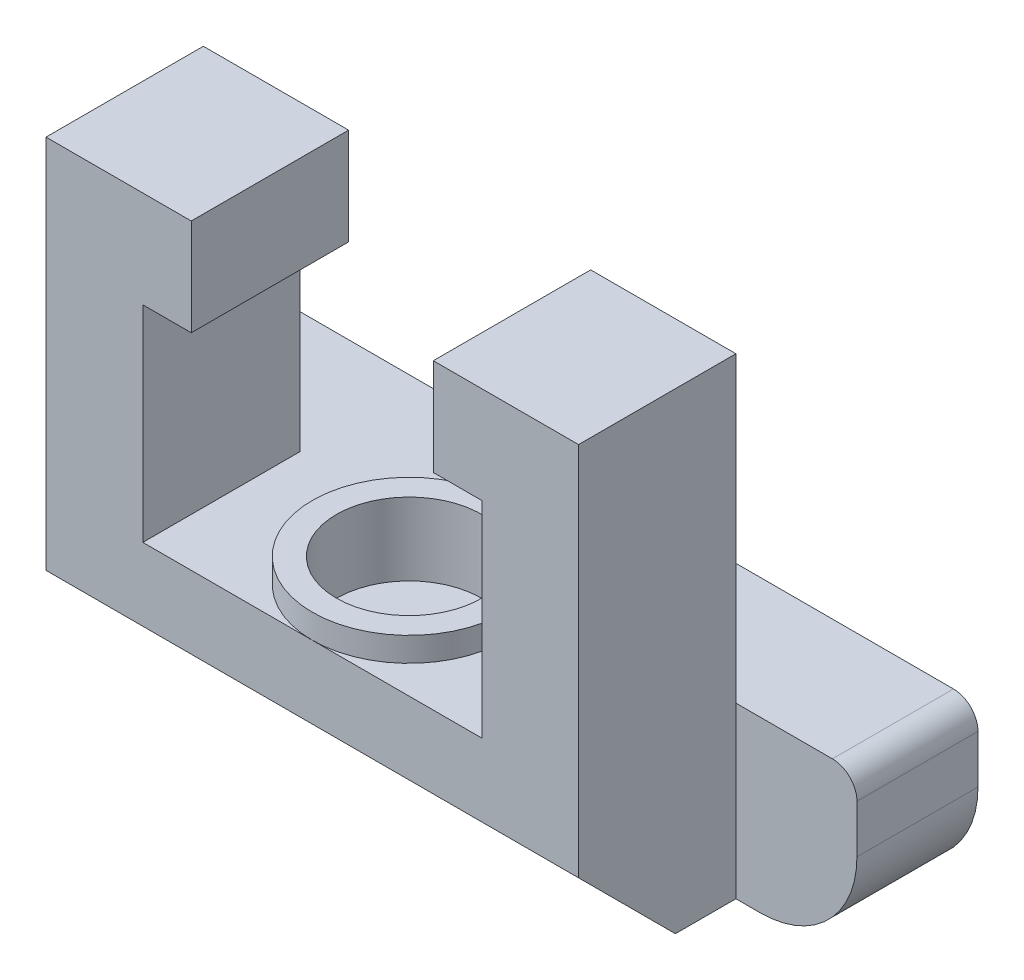
ISO-10303-21;
HEADER;
FILE_DESCRIPTION(('STEP AP214'),'2;1');
FILE_NAME('part.step','',(''),(''),'','','');
FILE_SCHEMA(('AUTOMOTIVE_DESIGN { 1 0 10303 214 1 1 1 1 }'));
ENDSEC;
DATA;
#1=APPLICATION_CONTEXT('core data for automotive mechanical design processes');
#2=APPLICATION_PROTOCOL_DEFINITION('international standard','automotive_design',2000,#1);
#3=PRODUCT_CONTEXT('',#1,'mechanical');
#4=PRODUCT('Part','Part','',(#3));
#5=PRODUCT_RELATED_PRODUCT_CATEGORY('part','',(#4));
#6=PRODUCT_DEFINITION_FORMATION('','',#4);
#7=PRODUCT_DEFINITION_CONTEXT('part definition',#1,'design');
#8=PRODUCT_DEFINITION('design','',#6,#7);
#9=PRODUCT_DEFINITION_SHAPE('','',#8);
#10=(LENGTH_UNIT() NAMED_UNIT(*) SI_UNIT(.MILLI.,.METRE.));
#11=(NAMED_UNIT(*) PLANE_ANGLE_UNIT() SI_UNIT($,.RADIAN.));
#12=(NAMED_UNIT(*) SI_UNIT($,.STERADIAN.) SOLID_ANGLE_UNIT());
#13=UNCERTAINTY_MEASURE_WITH_UNIT(LENGTH_MEASURE(1.E-05),#10,'distance_accuracy_value','');
#14=(GEOMETRIC_REPRESENTATION_CONTEXT(3) GLOBAL_UNCERTAINTY_ASSIGNED_CONTEXT((#13)) GLOBAL_UNIT_ASSIGNED_CONTEXT((#10,
#11,#12)) REPRESENTATION_CONTEXT('',''));
#15=CARTESIAN_POINT('',(0.,0.,0.));
#16=DIRECTION('',(0.,0.,1.));
#17=DIRECTION('',(1.,0.,0.));
#18=AXIS2_PLACEMENT_3D('',#15,#16,#17);
#19=CARTESIAN_POINT('',(-5.64642,-2.21742,5.24256));
#20=DIRECTION('',(0.,-1.,0.));
#21=DIRECTION('',(0.,0.,-1.));
#22=AXIS2_PLACEMENT_3D('',#19,#20,#21);
#23=PLANE('',#22);
#24=DIRECTION('',(-1.,0.,0.));
#25=VECTOR('',#24,1.);
#26=CARTESIAN_POINT('',(-5.64642,-2.21742,5.24256));
#27=LINE('',#26,#25);
#28=CARTESIAN_POINT('',(0.,-2.21742,5.24256));
#29=VERTEX_POINT('',#28);
#30=CARTESIAN_POINT('',(-5.64642,-2.21742,5.24256));
#31=VERTEX_POINT('',#30);
#32=EDGE_CURVE('E185',#29,#31,#27,.T.);
#33=ORIENTED_EDGE('',*,*,#32,.F.);
#34=CARTESIAN_POINT('',(0.,-2.21742,2.01676));
#35=DIRECTION('',(0.,1.,0.));
#36=DIRECTION('',(0.,0.,1.));
#37=AXIS2_PLACEMENT_3D('',#34,#35,#36);
#38=CIRCLE('',#37,3.2258);
#39=EDGE_CURVE('E196',#29,#29,#38,.T.);
#40=ORIENTED_EDGE('',*,*,#39,.F.);
#41=CARTESIAN_POINT('',(5.64642,-2.21742,5.24256));
#42=VERTEX_POINT('',#41);
#43=EDGE_CURVE('E181',#42,#29,#27,.T.);
#44=ORIENTED_EDGE('',*,*,#43,.F.);
#45=DIRECTION('',(0.,0.,-1.));
#46=VECTOR('',#45,1.);
#47=CARTESIAN_POINT('',(5.64642,-2.21742,5.24256));
#48=LINE('',#47,#46);
#49=CARTESIAN_POINT('',(5.64642,-2.21742,0.));
#50=VERTEX_POINT('',#49);
#51=EDGE_CURVE('E286',#42,#50,#48,.T.);
#52=ORIENTED_EDGE('',*,*,#51,.T.);
#53=DIRECTION('',(1.,0.,0.));
#54=VECTOR('',#53,1.);
#55=CARTESIAN_POINT('',(12.0882205718418,-2.21741999999999,0.));
#56=LINE('',#55,#54);
#57=CARTESIAN_POINT('',(8.87222,-2.21741999999999,0.));
#58=VERTEX_POINT('',#57);
#59=EDGE_CURVE('E261',#50,#58,#56,.T.);
#60=ORIENTED_EDGE('',*,*,#59,.T.);
#61=CARTESIAN_POINT('',(12.0882205718418,-2.21741999999999,0.));
#62=VERTEX_POINT('',#61);
#63=EDGE_CURVE('E302',#58,#62,#56,.T.);
#64=ORIENTED_EDGE('',*,*,#63,.T.);
#65=DIRECTION('',(0.,0.,1.));
#66=VECTOR('',#65,1.);
#67=CARTESIAN_POINT('',(12.0882205718418,-2.21741999999999,-4.03352));
#68=LINE('',#67,#66);
#69=CARTESIAN_POINT('',(12.0882205718418,-2.21741999999999,-4.03352));
#70=VERTEX_POINT('',#69);
#71=EDGE_CURVE('E486',#70,#62,#68,.T.);
#72=ORIENTED_EDGE('',*,*,#71,.F.);
#73=DIRECTION('',(1.,0.,0.));
#74=VECTOR('',#73,1.);
#75=CARTESIAN_POINT('',(12.0882205718418,-2.21741999999999,-4.03352));
#76=LINE('',#75,#74);
#77=CARTESIAN_POINT('',(-12.0882205718418,-2.21741999999999,-4.03352));
#78=VERTEX_POINT('',#77);
#79=EDGE_CURVE('E400',#78,#70,#76,.T.);
#80=ORIENTED_EDGE('',*,*,#79,.F.);
#81=DIRECTION('',(0.,0.,1.));
#82=VECTOR('',#81,1.);
#83=CARTESIAN_POINT('',(-12.0882205718418,-2.21741999999999,-4.03352));
#84=LINE('',#83,#82);
#85=CARTESIAN_POINT('',(-12.0882205718418,-2.21741999999999,0.));
#86=VERTEX_POINT('',#85);
#87=EDGE_CURVE('E489',#78,#86,#84,.T.);
#88=ORIENTED_EDGE('',*,*,#87,.T.);
#89=CARTESIAN_POINT('',(-8.87222,-2.21741999999999,0.));
#90=VERTEX_POINT('',#89);
#91=EDGE_CURVE('E296',#86,#90,#56,.T.);
#92=ORIENTED_EDGE('',*,*,#91,.T.);
#93=CARTESIAN_POINT('',(-5.64642,-2.21742,0.));
#94=VERTEX_POINT('',#93);
#95=EDGE_CURVE('E258',#90,#94,#56,.T.);
#96=ORIENTED_EDGE('',*,*,#95,.T.);
#97=DIRECTION('',(0.,0.,-1.));
#98=VECTOR('',#97,1.);
#99=CARTESIAN_POINT('',(-5.64642,-2.21742,5.24256));
#100=LINE('',#99,#98);
#101=EDGE_CURVE('E198',#31,#94,#100,.T.);
#102=ORIENTED_EDGE('',*,*,#101,.F.);
#103=EDGE_LOOP('',(#33,#40,#44,#52,#60,#64,#72,#80,#88,#92,#96,#102));
#104=FACE_BOUND('',#103,.T.);
#105=ADVANCED_FACE('F32',(#104),#23,.F.);
#106=CARTESIAN_POINT('',(0.,0.,0.));
#107=DIRECTION('',(0.,0.,1.));
#108=DIRECTION('',(1.,0.,0.));
#109=AXIS2_PLACEMENT_3D('',#106,#107,#108);
#110=PLANE('',#109);
#111=ORIENTED_EDGE('',*,*,#95,.F.);
#112=DIRECTION('',(0.,-1.,0.));
#113=VECTOR('',#112,1.);
#114=CARTESIAN_POINT('',(-8.87222,-7.86383999999999,0.));
#115=LINE('',#114,#113);
#116=CARTESIAN_POINT('',(-8.87222,7.86384,0.));
#117=VERTEX_POINT('',#116);
#118=EDGE_CURVE('E233',#117,#90,#115,.T.);
#119=ORIENTED_EDGE('',*,*,#118,.F.);
#120=DIRECTION('',(-1.,0.,0.));
#121=VECTOR('',#120,1.);
#122=CARTESIAN_POINT('',(-8.87222,7.86384,0.));
#123=LINE('',#122,#121);
#124=CARTESIAN_POINT('',(-4.03225,7.86384,0.));
#125=VERTEX_POINT('',#124);
#126=EDGE_CURVE('E230',#125,#117,#123,.T.);
#127=ORIENTED_EDGE('',*,*,#126,.F.);
#128=DIRECTION('',(0.,1.,0.));
#129=VECTOR('',#128,1.);
#130=CARTESIAN_POINT('',(-4.03225,4.63804,0.));
#131=LINE('',#130,#129);
#132=CARTESIAN_POINT('',(-4.03225,4.63804,0.));
#133=VERTEX_POINT('',#132);
#134=EDGE_CURVE('E227',#133,#125,#131,.T.);
#135=ORIENTED_EDGE('',*,*,#134,.F.);
#136=DIRECTION('',(1.,0.,0.));
#137=VECTOR('',#136,1.);
#138=CARTESIAN_POINT('',(-5.64642,4.63804,0.));
#139=LINE('',#138,#137);
#140=CARTESIAN_POINT('',(-5.64642,4.63804,0.));
#141=VERTEX_POINT('',#140);
#142=EDGE_CURVE('E225',#141,#133,#139,.T.);
#143=ORIENTED_EDGE('',*,*,#142,.F.);
#144=DIRECTION('',(0.,1.,0.));
#145=VECTOR('',#144,1.);
#146=CARTESIAN_POINT('',(-5.64642,-2.21742,0.));
#147=LINE('',#146,#145);
#148=EDGE_CURVE('E228',#94,#141,#147,.T.);
#149=ORIENTED_EDGE('',*,*,#148,.F.);
#150=EDGE_LOOP('',(#111,#119,#127,#135,#143,#149));
#151=FACE_BOUND('',#150,.T.);
#152=ADVANCED_FACE('F346',(#151),#110,.F.);
#153=ORIENTED_EDGE('',*,*,#59,.F.);
#154=DIRECTION('',(0.,-1.,0.));
#155=VECTOR('',#154,1.);
#156=CARTESIAN_POINT('',(5.64642,-2.21742,0.));
#157=LINE('',#156,#155);
#158=CARTESIAN_POINT('',(5.64642,4.63804,0.));
#159=VERTEX_POINT('',#158);
#160=EDGE_CURVE('E224',#159,#50,#157,.T.);
#161=ORIENTED_EDGE('',*,*,#160,.F.);
#162=DIRECTION('',(1.,0.,0.));
#163=VECTOR('',#162,1.);
#164=CARTESIAN_POINT('',(4.03225,4.63804,0.));
#165=LINE('',#164,#163);
#166=CARTESIAN_POINT('',(4.03225,4.63804,0.));
#167=VERTEX_POINT('',#166);
#168=EDGE_CURVE('E222',#167,#159,#165,.T.);
#169=ORIENTED_EDGE('',*,*,#168,.F.);
#170=DIRECTION('',(0.,-1.,0.));
#171=VECTOR('',#170,1.);
#172=CARTESIAN_POINT('',(4.03225,4.63804,0.));
#173=LINE('',#172,#171);
#174=CARTESIAN_POINT('',(4.03225,7.86384,0.));
#175=VERTEX_POINT('',#174);
#176=EDGE_CURVE('E219',#175,#167,#173,.T.);
#177=ORIENTED_EDGE('',*,*,#176,.F.);
#178=DIRECTION('',(-1.,0.,0.));
#179=VECTOR('',#178,1.);
#180=CARTESIAN_POINT('',(4.03225,7.86384,0.));
#181=LINE('',#180,#179);
#182=CARTESIAN_POINT('',(8.87222,7.86384,0.));
#183=VERTEX_POINT('',#182);
#184=EDGE_CURVE('E216',#183,#175,#181,.T.);
#185=ORIENTED_EDGE('',*,*,#184,.F.);
#186=DIRECTION('',(0.,1.,0.));
#187=VECTOR('',#186,1.);
#188=CARTESIAN_POINT('',(8.87222,-7.86383999999999,0.));
#189=LINE('',#188,#187);
#190=EDGE_CURVE('E237',#58,#183,#189,.T.);
#191=ORIENTED_EDGE('',*,*,#190,.F.);
#192=EDGE_LOOP('',(#153,#161,#169,#177,#185,#191));
#193=FACE_BOUND('',#192,.T.);
#194=ADVANCED_FACE('F443',(#193),#110,.F.);
#195=CARTESIAN_POINT('',(4.03225,7.86384,5.24256));
#196=DIRECTION('',(0.,-1.,0.));
#197=DIRECTION('',(0.,0.,-1.));
#198=AXIS2_PLACEMENT_3D('',#195,#196,#197);
#199=PLANE('',#198);
#200=ORIENTED_EDGE('',*,*,#184,.T.);
#201=DIRECTION('',(0.,0.,-1.));
#202=VECTOR('',#201,1.);
#203=CARTESIAN_POINT('',(4.03225,7.86384,5.24256));
#204=LINE('',#203,#202);
#205=CARTESIAN_POINT('',(4.03225,7.86384,5.24256));
#206=VERTEX_POINT('',#205);
#207=EDGE_CURVE('E289',#206,#175,#204,.T.);
#208=ORIENTED_EDGE('',*,*,#207,.F.);
#209=DIRECTION('',(-1.,0.,0.));
#210=VECTOR('',#209,1.);
#211=CARTESIAN_POINT('',(4.03225,7.86384,5.24256));
#212=LINE('',#211,#210);
#213=CARTESIAN_POINT('',(8.87222,7.86384,5.24256));
#214=VERTEX_POINT('',#213);
#215=EDGE_CURVE('E314',#214,#206,#212,.T.);
#216=ORIENTED_EDGE('',*,*,#215,.F.);
#217=DIRECTION('',(0.,0.,-1.));
#218=VECTOR('',#217,1.);
#219=CARTESIAN_POINT('',(8.87222,7.86384,5.24256));
#220=LINE('',#219,#218);
#221=EDGE_CURVE('E215',#214,#183,#220,.T.);
#222=ORIENTED_EDGE('',*,*,#221,.T.);
#223=EDGE_LOOP('',(#200,#208,#216,#222));
#224=FACE_BOUND('',#223,.T.);
#225=ADVANCED_FACE('F454',(#224),#199,.F.);
#226=CARTESIAN_POINT('',(4.03225,4.63804,5.24256));
#227=DIRECTION('',(1.,0.,0.));
#228=DIRECTION('',(0.,0.,-1.));
#229=AXIS2_PLACEMENT_3D('',#226,#227,#228);
#230=PLANE('',#229);
#231=ORIENTED_EDGE('',*,*,#176,.T.);
#232=DIRECTION('',(0.,0.,-1.));
#233=VECTOR('',#232,1.);
#234=CARTESIAN_POINT('',(4.03225,4.63804,5.24256));
#235=LINE('',#234,#233);
#236=CARTESIAN_POINT('',(4.03225,4.63804,5.24256));
#237=VERTEX_POINT('',#236);
#238=EDGE_CURVE('E285',#237,#167,#235,.T.);
#239=ORIENTED_EDGE('',*,*,#238,.F.);
#240=DIRECTION('',(0.,-1.,0.));
#241=VECTOR('',#240,1.);
#242=CARTESIAN_POINT('',(4.03225,4.63804,5.24256));
#243=LINE('',#242,#241);
#244=EDGE_CURVE('E317',#206,#237,#243,.T.);
#245=ORIENTED_EDGE('',*,*,#244,.F.);
#246=ORIENTED_EDGE('',*,*,#207,.T.);
#247=EDGE_LOOP('',(#231,#239,#245,#246));
#248=FACE_BOUND('',#247,.T.);
#249=ADVANCED_FACE('F452',(#248),#230,.F.);
#250=CARTESIAN_POINT('',(4.03225,4.63804,5.24256));
#251=DIRECTION('',(0.,1.,0.));
#252=DIRECTION('',(-1.,0.,0.));
#253=AXIS2_PLACEMENT_3D('',#250,#251,#252);
#254=PLANE('',#253);
#255=ORIENTED_EDGE('',*,*,#168,.T.);
#256=DIRECTION('',(0.,0.,-1.));
#257=VECTOR('',#256,1.);
#258=CARTESIAN_POINT('',(5.64642,4.63804,5.24256));
#259=LINE('',#258,#257);
#260=CARTESIAN_POINT('',(5.64642,4.63804,5.24256));
#261=VERTEX_POINT('',#260);
#262=EDGE_CURVE('E282',#261,#159,#259,.T.);
#263=ORIENTED_EDGE('',*,*,#262,.F.);
#264=DIRECTION('',(1.,0.,0.));
#265=VECTOR('',#264,1.);
#266=CARTESIAN_POINT('',(4.03225,4.63804,5.24256));
#267=LINE('',#266,#265);
#268=EDGE_CURVE('E200',#237,#261,#267,.T.);
#269=ORIENTED_EDGE('',*,*,#268,.F.);
#270=ORIENTED_EDGE('',*,*,#238,.T.);
#271=EDGE_LOOP('',(#255,#263,#269,#270));
#272=FACE_BOUND('',#271,.T.);
#273=ADVANCED_FACE('F322',(#272),#254,.F.);
#274=CARTESIAN_POINT('',(5.64642,-2.21742,5.24256));
#275=DIRECTION('',(1.,0.,0.));
#276=DIRECTION('',(0.,0.,-1.));
#277=AXIS2_PLACEMENT_3D('',#274,#275,#276);
#278=PLANE('',#277);
#279=ORIENTED_EDGE('',*,*,#160,.T.);
#280=ORIENTED_EDGE('',*,*,#51,.F.);
#281=DIRECTION('',(0.,-1.,0.));
#282=VECTOR('',#281,1.);
#283=CARTESIAN_POINT('',(5.64642,-2.21742,5.24256));
#284=LINE('',#283,#282);
#285=EDGE_CURVE('E188',#261,#42,#284,.T.);
#286=ORIENTED_EDGE('',*,*,#285,.F.);
#287=ORIENTED_EDGE('',*,*,#262,.T.);
#288=EDGE_LOOP('',(#279,#280,#286,#287));
#289=FACE_BOUND('',#288,.T.);
#290=ADVANCED_FACE('F327',(#289),#278,.F.);
#291=CARTESIAN_POINT('',(-5.64642,-2.21742,5.24256));
#292=DIRECTION('',(-1.,0.,0.));
#293=DIRECTION('',(0.,-1.,0.));
#294=AXIS2_PLACEMENT_3D('',#291,#292,#293);
#295=PLANE('',#294);
#296=ORIENTED_EDGE('',*,*,#148,.T.);
#297=DIRECTION('',(0.,0.,-1.));
#298=VECTOR('',#297,1.);
#299=CARTESIAN_POINT('',(-5.64642,4.63804,5.24256));
#300=LINE('',#299,#298);
#301=CARTESIAN_POINT('',(-5.64642,4.63804,5.24256));
#302=VERTEX_POINT('',#301);
#303=EDGE_CURVE('E279',#302,#141,#300,.T.);
#304=ORIENTED_EDGE('',*,*,#303,.F.);
#305=DIRECTION('',(0.,1.,0.));
#306=VECTOR('',#305,1.);
#307=CARTESIAN_POINT('',(-5.64642,-2.21742,5.24256));
#308=LINE('',#307,#306);
#309=EDGE_CURVE('E193',#31,#302,#308,.T.);
#310=ORIENTED_EDGE('',*,*,#309,.F.);
#311=ORIENTED_EDGE('',*,*,#101,.T.);
#312=EDGE_LOOP('',(#296,#304,#310,#311));
#313=FACE_BOUND('',#312,.T.);
#314=ADVANCED_FACE('F338',(#313),#295,.F.);
#315=CARTESIAN_POINT('',(-5.64642,4.63804,5.24256));
#316=DIRECTION('',(0.,1.,0.));
#317=DIRECTION('',(0.,0.,1.));
#318=AXIS2_PLACEMENT_3D('',#315,#316,#317);
#319=PLANE('',#318);
#320=ORIENTED_EDGE('',*,*,#142,.T.);
#321=DIRECTION('',(0.,0.,-1.));
#322=VECTOR('',#321,1.);
#323=CARTESIAN_POINT('',(-4.03225,4.63804,5.24256));
#324=LINE('',#323,#322);
#325=CARTESIAN_POINT('',(-4.03225,4.63804,5.24256));
#326=VERTEX_POINT('',#325);
#327=EDGE_CURVE('E276',#326,#133,#324,.T.);
#328=ORIENTED_EDGE('',*,*,#327,.F.);
#329=DIRECTION('',(1.,0.,0.));
#330=VECTOR('',#329,1.);
#331=CARTESIAN_POINT('',(-5.64642,4.63804,5.24256));
#332=LINE('',#331,#330);
#333=EDGE_CURVE('E205',#302,#326,#332,.T.);
#334=ORIENTED_EDGE('',*,*,#333,.F.);
#335=ORIENTED_EDGE('',*,*,#303,.T.);
#336=EDGE_LOOP('',(#320,#328,#334,#335));
#337=FACE_BOUND('',#336,.T.);
#338=ADVANCED_FACE('F343',(#337),#319,.F.);
#339=CARTESIAN_POINT('',(-4.03225,4.63804,5.24256));
#340=DIRECTION('',(-1.,0.,0.));
#341=DIRECTION('',(0.,0.,1.));
#342=AXIS2_PLACEMENT_3D('',#339,#340,#341);
#343=PLANE('',#342);
#344=ORIENTED_EDGE('',*,*,#134,.T.);
#345=DIRECTION('',(0.,0.,-1.));
#346=VECTOR('',#345,1.);
#347=CARTESIAN_POINT('',(-4.03225,7.86384,5.24256));
#348=LINE('',#347,#346);
#349=CARTESIAN_POINT('',(-4.03225,7.86384,5.24256));
#350=VERTEX_POINT('',#349);
#351=EDGE_CURVE('E273',#350,#125,#348,.T.);
#352=ORIENTED_EDGE('',*,*,#351,.F.);
#353=DIRECTION('',(0.,1.,0.));
#354=VECTOR('',#353,1.);
#355=CARTESIAN_POINT('',(-4.03225,4.63804,5.24256));
#356=LINE('',#355,#354);
#357=EDGE_CURVE('E207',#326,#350,#356,.T.);
#358=ORIENTED_EDGE('',*,*,#357,.F.);
#359=ORIENTED_EDGE('',*,*,#327,.T.);
#360=EDGE_LOOP('',(#344,#352,#358,#359));
#361=FACE_BOUND('',#360,.T.);
#362=ADVANCED_FACE('F351',(#361),#343,.F.);
#363=CARTESIAN_POINT('',(-8.87222,7.86384,5.24256));
#364=DIRECTION('',(0.,-1.,0.));
#365=DIRECTION('',(0.,0.,-1.));
#366=AXIS2_PLACEMENT_3D('',#363,#364,#365);
#367=PLANE('',#366);
#368=ORIENTED_EDGE('',*,*,#126,.T.);
#369=DIRECTION('',(0.,0.,-1.));
#370=VECTOR('',#369,1.);
#371=CARTESIAN_POINT('',(-8.87222,7.86384,5.24256));
#372=LINE('',#371,#370);
#373=CARTESIAN_POINT('',(-8.87222,7.86384,5.24256));
#374=VERTEX_POINT('',#373);
#375=EDGE_CURVE('E253',#374,#117,#372,.T.);
#376=ORIENTED_EDGE('',*,*,#375,.F.);
#377=DIRECTION('',(-1.,0.,0.));
#378=VECTOR('',#377,1.);
#379=CARTESIAN_POINT('',(-8.87222,7.86384,5.24256));
#380=LINE('',#379,#378);
#381=EDGE_CURVE('E209',#350,#374,#380,.T.);
#382=ORIENTED_EDGE('',*,*,#381,.F.);
#383=ORIENTED_EDGE('',*,*,#351,.T.);
#384=EDGE_LOOP('',(#368,#376,#382,#383));
#385=FACE_BOUND('',#384,.T.);
#386=ADVANCED_FACE('F355',(#385),#367,.F.);
#387=CARTESIAN_POINT('',(-8.87222,-7.86383999999999,5.24256));
#388=DIRECTION('',(1.,0.,0.));
#389=DIRECTION('',(0.,0.,-1.));
#390=AXIS2_PLACEMENT_3D('',#387,#388,#389);
#391=PLANE('',#390);
#392=DIRECTION('',(0.,0.,-1.));
#393=VECTOR('',#392,1.);
#394=CARTESIAN_POINT('',(-8.87222,-7.86383999999999,5.24256));
#395=LINE('',#394,#393);
#396=CARTESIAN_POINT('',(-8.87222,-7.86383999999999,2.01675999999999));
#397=VERTEX_POINT('',#396);
#398=CARTESIAN_POINT('',(-8.87222,-7.86383999999999,0.));
#399=VERTEX_POINT('',#398);
#400=EDGE_CURVE('E251',#397,#399,#395,.T.);
#401=ORIENTED_EDGE('',*,*,#400,.F.);
#402=DIRECTION('',(0.,0.707106781186548,0.707106781186548));
#403=VECTOR('',#402,1.);
#404=CARTESIAN_POINT('',(-8.87222,-4.63803999999998,5.24256));
#405=LINE('',#404,#403);
#406=CARTESIAN_POINT('',(-8.87222,-4.63803999999998,5.24256));
#407=VERTEX_POINT('',#406);
#408=EDGE_CURVE('E11',#397,#407,#405,.T.);
#409=ORIENTED_EDGE('',*,*,#408,.T.);
#410=DIRECTION('',(0.,-1.,0.));
#411=VECTOR('',#410,1.);
#412=CARTESIAN_POINT('',(-8.87222,-7.86383999999999,5.24256));
#413=LINE('',#412,#411);
#414=EDGE_CURVE('E211',#374,#407,#413,.T.);
#415=ORIENTED_EDGE('',*,*,#414,.F.);
#416=ORIENTED_EDGE('',*,*,#375,.T.);
#417=ORIENTED_EDGE('',*,*,#118,.T.);
#418=EDGE_CURVE('E232',#90,#399,#115,.T.);
#419=ORIENTED_EDGE('',*,*,#418,.T.);
#420=EDGE_LOOP('',(#401,#409,#415,#416,#417,#419));
#421=FACE_BOUND('',#420,.T.);
#422=ADVANCED_FACE('F361',(#421),#391,.F.);
#423=CARTESIAN_POINT('',(-8.87222,-7.86383999999999,5.24256));
#424=DIRECTION('',(0.,1.,0.));
#425=DIRECTION('',(0.,0.,1.));
#426=AXIS2_PLACEMENT_3D('',#423,#424,#425);
#427=PLANE('',#426);
#428=DIRECTION('',(0.,0.,-1.));
#429=VECTOR('',#428,1.);
#430=CARTESIAN_POINT('',(8.87222,-7.86383999999999,5.24256));
#431=LINE('',#430,#429);
#432=CARTESIAN_POINT('',(8.87222,-7.86383999999999,2.01675999999999));
#433=VERTEX_POINT('',#432);
#434=CARTESIAN_POINT('',(8.87222,-7.86383999999999,0.));
#435=VERTEX_POINT('',#434);
#436=EDGE_CURVE('E254',#433,#435,#431,.T.);
#437=ORIENTED_EDGE('',*,*,#436,.F.);
#438=DIRECTION('',(-1.,0.,0.));
#439=VECTOR('',#438,1.);
#440=CARTESIAN_POINT('',(-8.87222,-7.86383999999999,2.01675999999999));
#441=LINE('',#440,#439);
#442=EDGE_CURVE('E40',#433,#397,#441,.T.);
#443=ORIENTED_EDGE('',*,*,#442,.T.);
#444=ORIENTED_EDGE('',*,*,#400,.T.);
#445=DIRECTION('',(-1.,0.,0.));
#446=VECTOR('',#445,1.);
#447=CARTESIAN_POINT('',(9.67866999999998,-7.86383999999999,0.));
#448=LINE('',#447,#446);
#449=CARTESIAN_POINT('',(-9.67866999999998,-7.86383999999999,0.));
#450=VERTEX_POINT('',#449);
#451=EDGE_CURVE('E311',#399,#450,#448,.T.);
#452=ORIENTED_EDGE('',*,*,#451,.T.);
#453=DIRECTION('',(0.,0.,1.));
#454=VECTOR('',#453,1.);
#455=CARTESIAN_POINT('',(-9.67866999999998,-7.86383999999999,-4.03352));
#456=LINE('',#455,#454);
#457=CARTESIAN_POINT('',(-9.67866999999998,-7.86383999999999,-4.03352));
#458=VERTEX_POINT('',#457);
#459=EDGE_CURVE('E368',#458,#450,#456,.T.);
#460=ORIENTED_EDGE('',*,*,#459,.F.);
#461=DIRECTION('',(-1.,0.,0.));
#462=VECTOR('',#461,1.);
#463=CARTESIAN_POINT('',(9.67866999999998,-7.86383999999999,-4.03352));
#464=LINE('',#463,#462);
#465=CARTESIAN_POINT('',(9.67866999999998,-7.86383999999999,-4.03352));
#466=VERTEX_POINT('',#465);
#467=EDGE_CURVE('E382',#466,#458,#464,.T.);
#468=ORIENTED_EDGE('',*,*,#467,.F.);
#469=DIRECTION('',(0.,0.,1.));
#470=VECTOR('',#469,1.);
#471=CARTESIAN_POINT('',(9.67866999999998,-7.86383999999999,-4.03352));
#472=LINE('',#471,#470);
#473=CARTESIAN_POINT('',(9.67866999999998,-7.86383999999999,0.));
#474=VERTEX_POINT('',#473);
#475=EDGE_CURVE('E381',#466,#474,#472,.T.);
#476=ORIENTED_EDGE('',*,*,#475,.T.);
#477=EDGE_CURVE('E372',#474,#435,#448,.T.);
#478=ORIENTED_EDGE('',*,*,#477,.T.);
#479=EDGE_LOOP('',(#437,#443,#444,#452,#460,#468,#476,#478));
#480=FACE_BOUND('',#479,.T.);
#481=ADVANCED_FACE('F364',(#480),#427,.F.);
#482=CARTESIAN_POINT('',(8.87222,-7.86383999999999,5.24256));
#483=DIRECTION('',(-1.,0.,0.));
#484=DIRECTION('',(0.,0.,1.));
#485=AXIS2_PLACEMENT_3D('',#482,#483,#484);
#486=PLANE('',#485);
#487=DIRECTION('',(0.,1.,0.));
#488=VECTOR('',#487,1.);
#489=CARTESIAN_POINT('',(8.87222,-7.86383999999999,5.24256));
#490=LINE('',#489,#488);
#491=CARTESIAN_POINT('',(8.87222,-4.63803999999998,5.24256));
#492=VERTEX_POINT('',#491);
#493=EDGE_CURVE('E213',#492,#214,#490,.T.);
#494=ORIENTED_EDGE('',*,*,#493,.F.);
#495=DIRECTION('',(0.,-0.707106781186548,-0.707106781186548));
#496=VECTOR('',#495,1.);
#497=CARTESIAN_POINT('',(8.87222,-4.63803999999998,5.24256));
#498=LINE('',#497,#496);
#499=EDGE_CURVE('E54',#492,#433,#498,.T.);
#500=ORIENTED_EDGE('',*,*,#499,.T.);
#501=ORIENTED_EDGE('',*,*,#436,.T.);
#502=EDGE_CURVE('E263',#435,#58,#189,.T.);
#503=ORIENTED_EDGE('',*,*,#502,.T.);
#504=ORIENTED_EDGE('',*,*,#190,.T.);
#505=ORIENTED_EDGE('',*,*,#221,.F.);
#506=EDGE_LOOP('',(#494,#500,#501,#503,#504,#505));
#507=FACE_BOUND('',#506,.T.);
#508=ADVANCED_FACE('F464',(#507),#486,.F.);
#509=CARTESIAN_POINT('',(0.,0.,5.24256));
#510=DIRECTION('',(0.,0.,1.));
#511=DIRECTION('',(1.,0.,0.));
#512=AXIS2_PLACEMENT_3D('',#509,#510,#511);
#513=PLANE('',#512);
#514=ORIENTED_EDGE('',*,*,#414,.T.);
#515=DIRECTION('',(1.,0.,0.));
#516=VECTOR('',#515,1.);
#517=CARTESIAN_POINT('',(8.87222,-4.63803999999998,5.24256));
#518=LINE('',#517,#516);
#519=EDGE_CURVE('E256',#407,#492,#518,.T.);
#520=ORIENTED_EDGE('',*,*,#519,.T.);
#521=ORIENTED_EDGE('',*,*,#493,.T.);
#522=ORIENTED_EDGE('',*,*,#215,.T.);
#523=ORIENTED_EDGE('',*,*,#244,.T.);
#524=ORIENTED_EDGE('',*,*,#268,.T.);
#525=ORIENTED_EDGE('',*,*,#285,.T.);
#526=ORIENTED_EDGE('',*,*,#43,.T.);
#527=ORIENTED_EDGE('',*,*,#32,.T.);
#528=ORIENTED_EDGE('',*,*,#309,.T.);
#529=ORIENTED_EDGE('',*,*,#333,.T.);
#530=ORIENTED_EDGE('',*,*,#357,.T.);
#531=ORIENTED_EDGE('',*,*,#381,.T.);
#532=EDGE_LOOP('',(#514,#520,#521,#522,#523,#524,#525,#526,#527,#528,#529,#530,#531));
#533=FACE_BOUND('',#532,.T.);
#534=ADVANCED_FACE('F184',(#533),#513,.T.);
#535=CARTESIAN_POINT('',(-9.67867,-4.63803999999999,0.));
#536=DIRECTION('',(0.,0.,1.));
#537=DIRECTION('',(1.,0.,0.));
#538=AXIS2_PLACEMENT_3D('',#535,#536,#537);
#539=PLANE('',#538);
#540=ORIENTED_EDGE('',*,*,#502,.F.);
#541=ORIENTED_EDGE('',*,*,#477,.F.);
#542=CARTESIAN_POINT('',(9.67867,-4.63803999999999,0.));
#543=DIRECTION('',(0.,0.,-1.));
#544=DIRECTION('',(-1.,0.,0.));
#545=AXIS2_PLACEMENT_3D('',#542,#543,#544);
#546=CIRCLE('',#545,3.2258);
#547=CARTESIAN_POINT('',(12.90447,-4.63803999999997,0.));
#548=VERTEX_POINT('',#547);
#549=EDGE_CURVE('E373',#548,#474,#546,.T.);
#550=ORIENTED_EDGE('',*,*,#549,.F.);
#551=DIRECTION('',(0.,-1.,0.));
#552=VECTOR('',#551,1.);
#553=CARTESIAN_POINT('',(12.90447,-3.03366942815823,0.));
#554=LINE('',#553,#552);
#555=CARTESIAN_POINT('',(12.90447,-3.03366942815823,0.));
#556=VERTEX_POINT('',#555);
#557=EDGE_CURVE('E505',#556,#548,#554,.T.);
#558=ORIENTED_EDGE('',*,*,#557,.F.);
#559=CARTESIAN_POINT('',(12.0882205718418,-3.03366942815822,0.));
#560=DIRECTION('',(0.,0.,-1.));
#561=DIRECTION('',(1.,0.,0.));
#562=AXIS2_PLACEMENT_3D('',#559,#560,#561);
#563=CIRCLE('',#562,0.816249428158233);
#564=EDGE_CURVE('E301',#62,#556,#563,.T.);
#565=ORIENTED_EDGE('',*,*,#564,.F.);
#566=ORIENTED_EDGE('',*,*,#63,.F.);
#567=EDGE_LOOP('',(#540,#541,#550,#558,#565,#566));
#568=FACE_BOUND('',#567,.T.);
#569=ADVANCED_FACE('F468',(#568),#539,.T.);
#570=ORIENTED_EDGE('',*,*,#418,.F.);
#571=ORIENTED_EDGE('',*,*,#91,.F.);
#572=CARTESIAN_POINT('',(-12.0882205718418,-3.03366942815822,0.));
#573=DIRECTION('',(0.,0.,-1.));
#574=DIRECTION('',(-1.,0.,0.));
#575=AXIS2_PLACEMENT_3D('',#572,#573,#574);
#576=CIRCLE('',#575,0.816249428158233);
#577=CARTESIAN_POINT('',(-12.90447,-3.03366942815823,0.));
#578=VERTEX_POINT('',#577);
#579=EDGE_CURVE('E303',#578,#86,#576,.T.);
#580=ORIENTED_EDGE('',*,*,#579,.F.);
#581=DIRECTION('',(0.,1.,0.));
#582=VECTOR('',#581,1.);
#583=CARTESIAN_POINT('',(-12.90447,-4.63803999999997,0.));
#584=LINE('',#583,#582);
#585=CARTESIAN_POINT('',(-12.90447,-4.63803999999997,0.));
#586=VERTEX_POINT('',#585);
#587=EDGE_CURVE('E386',#586,#578,#584,.T.);
#588=ORIENTED_EDGE('',*,*,#587,.F.);
#589=CARTESIAN_POINT('',(-9.67867,-4.63803999999999,0.));
#590=DIRECTION('',(0.,0.,-1.));
#591=DIRECTION('',(1.,0.,0.));
#592=AXIS2_PLACEMENT_3D('',#589,#590,#591);
#593=CIRCLE('',#592,3.2258);
#594=EDGE_CURVE('E378',#450,#586,#593,.T.);
#595=ORIENTED_EDGE('',*,*,#594,.F.);
#596=ORIENTED_EDGE('',*,*,#451,.F.);
#597=EDGE_LOOP('',(#570,#571,#580,#588,#595,#596));
#598=FACE_BOUND('',#597,.T.);
#599=ADVANCED_FACE('F384',(#598),#539,.T.);
#600=CARTESIAN_POINT('',(-9.67867,-4.63803999999999,-4.03352));
#601=DIRECTION('',(0.,0.,1.));
#602=DIRECTION('',(1.,0.,0.));
#603=AXIS2_PLACEMENT_3D('',#600,#601,#602);
#604=CYLINDRICAL_SURFACE('',#603,3.2258);
#605=ORIENTED_EDGE('',*,*,#594,.T.);
#606=DIRECTION('',(0.,0.,1.));
#607=VECTOR('',#606,1.);
#608=CARTESIAN_POINT('',(-12.90447,-4.63803999999997,-4.03352));
#609=LINE('',#608,#607);
#610=CARTESIAN_POINT('',(-12.90447,-4.63803999999997,-4.03352));
#611=VERTEX_POINT('',#610);
#612=EDGE_CURVE('E220',#611,#586,#609,.T.);
#613=ORIENTED_EDGE('',*,*,#612,.F.);
#614=CARTESIAN_POINT('',(-9.67867,-4.63803999999999,-4.03352));
#615=DIRECTION('',(0.,0.,-1.));
#616=DIRECTION('',(1.,0.,0.));
#617=AXIS2_PLACEMENT_3D('',#614,#615,#616);
#618=CIRCLE('',#617,3.2258);
#619=EDGE_CURVE('E380',#458,#611,#618,.T.);
#620=ORIENTED_EDGE('',*,*,#619,.F.);
#621=ORIENTED_EDGE('',*,*,#459,.T.);
#622=EDGE_LOOP('',(#605,#613,#620,#621));
#623=FACE_BOUND('',#622,.T.);
#624=ADVANCED_FACE('F376',(#623),#604,.T.);
#625=CARTESIAN_POINT('',(-12.90447,-4.63803999999997,-4.03352));
#626=DIRECTION('',(1.,0.,0.));
#627=DIRECTION('',(0.,0.,-1.));
#628=AXIS2_PLACEMENT_3D('',#625,#626,#627);
#629=PLANE('',#628);
#630=ORIENTED_EDGE('',*,*,#587,.T.);
#631=DIRECTION('',(0.,0.,1.));
#632=VECTOR('',#631,1.);
#633=CARTESIAN_POINT('',(-12.90447,-3.03366942815823,-4.03352));
#634=LINE('',#633,#632);
#635=CARTESIAN_POINT('',(-12.90447,-3.03366942815823,-4.03352));
#636=VERTEX_POINT('',#635);
#637=EDGE_CURVE('E491',#636,#578,#634,.T.);
#638=ORIENTED_EDGE('',*,*,#637,.F.);
#639=DIRECTION('',(0.,1.,0.));
#640=VECTOR('',#639,1.);
#641=CARTESIAN_POINT('',(-12.90447,-4.63803999999997,-4.03352));
#642=LINE('',#641,#640);
#643=EDGE_CURVE('E404',#611,#636,#642,.T.);
#644=ORIENTED_EDGE('',*,*,#643,.F.);
#645=ORIENTED_EDGE('',*,*,#612,.T.);
#646=EDGE_LOOP('',(#630,#638,#644,#645));
#647=FACE_BOUND('',#646,.T.);
#648=ADVANCED_FACE('F497',(#647),#629,.F.);
#649=CARTESIAN_POINT('',(-12.0882205718418,-3.03366942815822,-4.03352));
#650=DIRECTION('',(0.,0.,1.));
#651=DIRECTION('',(1.,0.,0.));
#652=AXIS2_PLACEMENT_3D('',#649,#650,#651);
#653=CYLINDRICAL_SURFACE('',#652,0.816249428158233);
#654=ORIENTED_EDGE('',*,*,#579,.T.);
#655=ORIENTED_EDGE('',*,*,#87,.F.);
#656=CARTESIAN_POINT('',(-12.0882205718418,-3.03366942815822,-4.03352));
#657=DIRECTION('',(0.,0.,-1.));
#658=DIRECTION('',(-1.,0.,0.));
#659=AXIS2_PLACEMENT_3D('',#656,#657,#658);
#660=CIRCLE('',#659,0.816249428158233);
#661=EDGE_CURVE('E402',#636,#78,#660,.T.);
#662=ORIENTED_EDGE('',*,*,#661,.F.);
#663=ORIENTED_EDGE('',*,*,#637,.T.);
#664=EDGE_LOOP('',(#654,#655,#662,#663));
#665=FACE_BOUND('',#664,.T.);
#666=ADVANCED_FACE('F520',(#665),#653,.T.);
#667=CARTESIAN_POINT('',(12.0882205718418,-3.03366942815822,-4.03352));
#668=DIRECTION('',(0.,0.,1.));
#669=DIRECTION('',(1.,0.,0.));
#670=AXIS2_PLACEMENT_3D('',#667,#668,#669);
#671=CYLINDRICAL_SURFACE('',#670,0.816249428158233);
#672=ORIENTED_EDGE('',*,*,#564,.T.);
#673=DIRECTION('',(0.,0.,1.));
#674=VECTOR('',#673,1.);
#675=CARTESIAN_POINT('',(12.90447,-3.03366942815823,-4.03352));
#676=LINE('',#675,#674);
#677=CARTESIAN_POINT('',(12.90447,-3.03366942815823,-4.03352));
#678=VERTEX_POINT('',#677);
#679=EDGE_CURVE('E483',#678,#556,#676,.T.);
#680=ORIENTED_EDGE('',*,*,#679,.F.);
#681=CARTESIAN_POINT('',(12.0882205718418,-3.03366942815822,-4.03352));
#682=DIRECTION('',(0.,0.,-1.));
#683=DIRECTION('',(1.,0.,0.));
#684=AXIS2_PLACEMENT_3D('',#681,#682,#683);
#685=CIRCLE('',#684,0.816249428158233);
#686=EDGE_CURVE('E398',#70,#678,#685,.T.);
#687=ORIENTED_EDGE('',*,*,#686,.F.);
#688=ORIENTED_EDGE('',*,*,#71,.T.);
#689=EDGE_LOOP('',(#672,#680,#687,#688));
#690=FACE_BOUND('',#689,.T.);
#691=ADVANCED_FACE('F509',(#690),#671,.T.);
#692=CARTESIAN_POINT('',(12.90447,-3.03366942815823,-4.03352));
#693=DIRECTION('',(-1.,0.,0.));
#694=DIRECTION('',(0.,0.,1.));
#695=AXIS2_PLACEMENT_3D('',#692,#693,#694);
#696=PLANE('',#695);
#697=ORIENTED_EDGE('',*,*,#557,.T.);
#698=DIRECTION('',(0.,0.,1.));
#699=VECTOR('',#698,1.);
#700=CARTESIAN_POINT('',(12.90447,-4.63803999999997,-4.03352));
#701=LINE('',#700,#699);
#702=CARTESIAN_POINT('',(12.90447,-4.63803999999997,-4.03352));
#703=VERTEX_POINT('',#702);
#704=EDGE_CURVE('E480',#703,#548,#701,.T.);
#705=ORIENTED_EDGE('',*,*,#704,.F.);
#706=DIRECTION('',(0.,-1.,0.));
#707=VECTOR('',#706,1.);
#708=CARTESIAN_POINT('',(12.90447,-3.03366942815823,-4.03352));
#709=LINE('',#708,#707);
#710=EDGE_CURVE('E396',#678,#703,#709,.T.);
#711=ORIENTED_EDGE('',*,*,#710,.F.);
#712=ORIENTED_EDGE('',*,*,#679,.T.);
#713=EDGE_LOOP('',(#697,#705,#711,#712));
#714=FACE_BOUND('',#713,.T.);
#715=ADVANCED_FACE('F512',(#714),#696,.F.);
#716=CARTESIAN_POINT('',(9.67867,-4.63803999999999,-4.03352));
#717=DIRECTION('',(0.,0.,1.));
#718=DIRECTION('',(1.,0.,0.));
#719=AXIS2_PLACEMENT_3D('',#716,#717,#718);
#720=CYLINDRICAL_SURFACE('',#719,3.2258);
#721=ORIENTED_EDGE('',*,*,#549,.T.);
#722=ORIENTED_EDGE('',*,*,#475,.F.);
#723=CARTESIAN_POINT('',(9.67867,-4.63803999999999,-4.03352));
#724=DIRECTION('',(0.,0.,-1.));
#725=DIRECTION('',(-1.,0.,0.));
#726=AXIS2_PLACEMENT_3D('',#723,#724,#725);
#727=CIRCLE('',#726,3.2258);
#728=EDGE_CURVE('E394',#703,#466,#727,.T.);
#729=ORIENTED_EDGE('',*,*,#728,.F.);
#730=ORIENTED_EDGE('',*,*,#704,.T.);
#731=EDGE_LOOP('',(#721,#722,#729,#730));
#732=FACE_BOUND('',#731,.T.);
#733=ADVANCED_FACE('F503',(#732),#720,.T.);
#734=CARTESIAN_POINT('',(-9.67867,-4.63803999999999,-4.03352));
#735=DIRECTION('',(0.,0.,1.));
#736=DIRECTION('',(1.,0.,0.));
#737=AXIS2_PLACEMENT_3D('',#734,#735,#736);
#738=PLANE('',#737);
#739=ORIENTED_EDGE('',*,*,#619,.T.);
#740=ORIENTED_EDGE('',*,*,#643,.T.);
#741=ORIENTED_EDGE('',*,*,#661,.T.);
#742=ORIENTED_EDGE('',*,*,#79,.T.);
#743=ORIENTED_EDGE('',*,*,#686,.T.);
#744=ORIENTED_EDGE('',*,*,#710,.T.);
#745=ORIENTED_EDGE('',*,*,#728,.T.);
#746=ORIENTED_EDGE('',*,*,#467,.T.);
#747=EDGE_LOOP('',(#739,#740,#741,#742,#743,#744,#745,#746));
#748=FACE_BOUND('',#747,.T.);
#749=ADVANCED_FACE('F436',(#748),#738,.F.);
#750=CARTESIAN_POINT('',(0.,-4.63803999999998,5.24256));
#751=DIRECTION('',(0.,-0.707106781186547,0.707106781186547));
#752=DIRECTION('',(-1.,0.,0.));
#753=AXIS2_PLACEMENT_3D('',#750,#751,#752);
#754=PLANE('',#753);
#755=ORIENTED_EDGE('',*,*,#408,.F.);
#756=ORIENTED_EDGE('',*,*,#442,.F.);
#757=ORIENTED_EDGE('',*,*,#499,.F.);
#758=ORIENTED_EDGE('',*,*,#519,.F.);
#759=EDGE_LOOP('',(#755,#756,#757,#758));
#760=FACE_BOUND('',#759,.T.);
#761=ADVANCED_FACE('F34',(#760),#754,.T.);
#762=CARTESIAN_POINT('',(0.,-1.4097,2.01676));
#763=DIRECTION('',(0.,-1.,0.));
#764=DIRECTION('',(0.,0.,-1.));
#765=AXIS2_PLACEMENT_3D('',#762,#763,#764);
#766=CYLINDRICAL_SURFACE('',#765,3.2258);
#767=CARTESIAN_POINT('',(0.,-1.4097,2.01676));
#768=DIRECTION('',(0.,1.,0.));
#769=DIRECTION('',(0.,0.,1.));
#770=AXIS2_PLACEMENT_3D('',#767,#768,#769);
#771=CIRCLE('',#770,3.2258);
#772=CARTESIAN_POINT('',(0.,-1.4097,5.24256));
#773=VERTEX_POINT('',#772);
#774=EDGE_CURVE('E388',#773,#773,#771,.T.);
#775=ORIENTED_EDGE('',*,*,#774,.F.);
#776=EDGE_LOOP('',(#775));
#777=FACE_BOUND('',#776,.T.);
#778=ORIENTED_EDGE('',*,*,#39,.T.);
#779=EDGE_LOOP('',(#778));
#780=FACE_BOUND('',#779,.T.);
#781=ADVANCED_FACE('F426',(#777,#780),#766,.T.);
#782=CARTESIAN_POINT('',(0.,-1.4097,2.01676));
#783=DIRECTION('',(0.,1.,0.));
#784=DIRECTION('',(0.,0.,1.));
#785=AXIS2_PLACEMENT_3D('',#782,#783,#784);
#786=PLANE('',#785);
#787=CARTESIAN_POINT('',(0.,-1.4097,2.01676));
#788=DIRECTION('',(0.,1.,0.));
#789=DIRECTION('',(0.,0.,1.));
#790=AXIS2_PLACEMENT_3D('',#787,#788,#789);
#791=CIRCLE('',#790,2.42062);
#792=CARTESIAN_POINT('',(0.,-1.4097,4.43738));
#793=VERTEX_POINT('',#792);
#794=EDGE_CURVE('E409',#793,#793,#791,.T.);
#795=ORIENTED_EDGE('',*,*,#794,.F.);
#796=EDGE_LOOP('',(#795));
#797=FACE_BOUND('',#796,.T.);
#798=ORIENTED_EDGE('',*,*,#774,.T.);
#799=EDGE_LOOP('',(#798));
#800=FACE_BOUND('',#799,.T.);
#801=ADVANCED_FACE('F420',(#797,#800),#786,.T.);
#802=CARTESIAN_POINT('',(0.,-3.83032,2.01676));
#803=DIRECTION('',(0.,1.,0.));
#804=DIRECTION('',(0.,0.,1.));
#805=AXIS2_PLACEMENT_3D('',#802,#803,#804);
#806=CYLINDRICAL_SURFACE('',#805,2.42062);
#807=CARTESIAN_POINT('',(0.,-3.83032,2.01676));
#808=DIRECTION('',(0.,1.,0.));
#809=DIRECTION('',(0.,0.,1.));
#810=AXIS2_PLACEMENT_3D('',#807,#808,#809);
#811=CIRCLE('',#810,2.42062);
#812=CARTESIAN_POINT('',(0.,-3.83032,4.43738));
#813=VERTEX_POINT('',#812);
#814=EDGE_CURVE('E407',#813,#813,#811,.T.);
#815=ORIENTED_EDGE('',*,*,#814,.F.);
#816=EDGE_LOOP('',(#815));
#817=FACE_BOUND('',#816,.T.);
#818=ORIENTED_EDGE('',*,*,#794,.T.);
#819=EDGE_LOOP('',(#818));
#820=FACE_BOUND('',#819,.T.);
#821=ADVANCED_FACE('F417',(#817,#820),#806,.F.);
#822=CARTESIAN_POINT('',(0.,-3.83032,2.01676));
#823=DIRECTION('',(0.,1.,0.));
#824=DIRECTION('',(0.,0.,1.));
#825=AXIS2_PLACEMENT_3D('',#822,#823,#824);
#826=PLANE('',#825);
#827=ORIENTED_EDGE('',*,*,#814,.T.);
#828=EDGE_LOOP('',(#827));
#829=FACE_BOUND('',#828,.T.);
#830=ADVANCED_FACE('F415',(#829),#826,.T.);
#831=CLOSED_SHELL('',(#105,#152,#194,#225,#249,#273,#290,#314,#338,#362,#386,#422,#481,#508,
#534,#569,#599,#624,#648,#666,#691,#715,#733,#749,#761,#781,#801,#821,#830));
#832=MANIFOLD_SOLID_BREP('B2',#831);
#833=ADVANCED_BREP_SHAPE_REPRESENTATION('',(#18,#832),#14);
#834=SHAPE_DEFINITION_REPRESENTATION(#9,#833);
ENDSEC;
END-ISO-10303-21;
